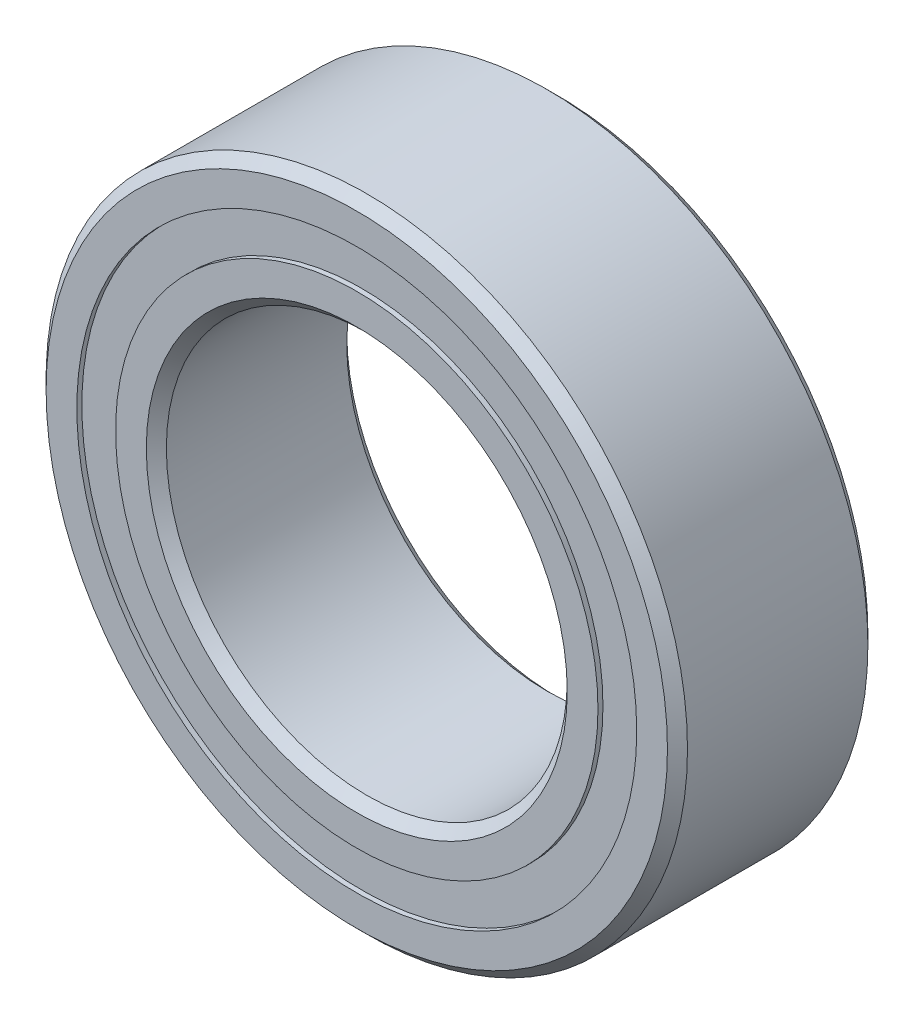
ISO-10303-21;
HEADER;
FILE_DESCRIPTION(('STEP AP214'),'2;1');
FILE_NAME('part.step','',(''),(''),'','','');
FILE_SCHEMA(('AUTOMOTIVE_DESIGN { 1 0 10303 214 1 1 1 1 }'));
ENDSEC;
DATA;
#1=APPLICATION_CONTEXT('core data for automotive mechanical design processes');
#2=APPLICATION_PROTOCOL_DEFINITION('international standard','automotive_design',2000,#1);
#3=PRODUCT_CONTEXT('',#1,'mechanical');
#4=PRODUCT('Part','Part','',(#3));
#5=PRODUCT_RELATED_PRODUCT_CATEGORY('part','',(#4));
#6=PRODUCT_DEFINITION_FORMATION('','',#4);
#7=PRODUCT_DEFINITION_CONTEXT('part definition',#1,'design');
#8=PRODUCT_DEFINITION('design','',#6,#7);
#9=PRODUCT_DEFINITION_SHAPE('','',#8);
#10=(LENGTH_UNIT() NAMED_UNIT(*) SI_UNIT(.MILLI.,.METRE.));
#11=(NAMED_UNIT(*) PLANE_ANGLE_UNIT() SI_UNIT($,.RADIAN.));
#12=(NAMED_UNIT(*) SI_UNIT($,.STERADIAN.) SOLID_ANGLE_UNIT());
#13=UNCERTAINTY_MEASURE_WITH_UNIT(LENGTH_MEASURE(1.E-05),#10,'distance_accuracy_value','');
#14=(GEOMETRIC_REPRESENTATION_CONTEXT(3) GLOBAL_UNCERTAINTY_ASSIGNED_CONTEXT((#13)) GLOBAL_UNIT_ASSIGNED_CONTEXT((#10,
#11,#12)) REPRESENTATION_CONTEXT('',''));
#15=CARTESIAN_POINT('',(0.,0.,0.));
#16=DIRECTION('',(0.,0.,1.));
#17=DIRECTION('',(1.,0.,0.));
#18=AXIS2_PLACEMENT_3D('',#15,#16,#17);
#19=CARTESIAN_POINT('',(0.,3.49175824175824,-1.1875));
#20=DIRECTION('',(0.,0.,1.));
#21=DIRECTION('',(1.,0.,0.));
#22=AXIS2_PLACEMENT_3D('',#19,#20,#21);
#23=PLANE('',#22);
#24=CARTESIAN_POINT('',(0.,0.,-1.1875));
#25=DIRECTION('',(0.,0.,1.));
#26=DIRECTION('',(1.,0.,0.));
#27=AXIS2_PLACEMENT_3D('',#24,#25,#26);
#28=CIRCLE('',#27,3.49175824175824);
#29=CARTESIAN_POINT('',(3.49175824175824,0.,-1.1875));
#30=VERTEX_POINT('',#29);
#31=EDGE_CURVE('E72',#30,#30,#28,.T.);
#32=ORIENTED_EDGE('',*,*,#31,.F.);
#33=EDGE_LOOP('',(#32));
#34=FACE_BOUND('',#33,.T.);
#35=CARTESIAN_POINT('',(0.,0.,-1.1875));
#36=DIRECTION('',(0.,0.,1.));
#37=DIRECTION('',(1.,0.,0.));
#38=AXIS2_PLACEMENT_3D('',#35,#36,#37);
#39=CIRCLE('',#38,3.00824175824176);
#40=CARTESIAN_POINT('',(3.00824175824176,0.,-1.1875));
#41=VERTEX_POINT('',#40);
#42=EDGE_CURVE('E11',#41,#41,#39,.T.);
#43=ORIENTED_EDGE('',*,*,#42,.T.);
#44=EDGE_LOOP('',(#43));
#45=FACE_BOUND('',#44,.T.);
#46=ADVANCED_FACE('F58',(#34,#45),#23,.F.);
#47=CARTESIAN_POINT('',(0.,0.,1.25));
#48=DIRECTION('',(0.,0.,1.));
#49=DIRECTION('',(1.,0.,0.));
#50=AXIS2_PLACEMENT_3D('',#47,#48,#49);
#51=CYLINDRICAL_SURFACE('',#50,3.00824175824176);
#52=ORIENTED_EDGE('',*,*,#42,.F.);
#53=EDGE_LOOP('',(#52));
#54=FACE_BOUND('',#53,.T.);
#55=CARTESIAN_POINT('',(0.,0.,-0.605878719519575));
#56=DIRECTION('',(0.,0.,1.));
#57=DIRECTION('',(1.,0.,0.));
#58=AXIS2_PLACEMENT_3D('',#55,#56,#57);
#59=CIRCLE('',#58,3.00824175824176);
#60=CARTESIAN_POINT('',(3.00824175824176,0.,-0.605878719519575));
#61=VERTEX_POINT('',#60);
#62=EDGE_CURVE('E64',#61,#61,#59,.T.);
#63=ORIENTED_EDGE('',*,*,#62,.T.);
#64=EDGE_LOOP('',(#63));
#65=FACE_BOUND('',#64,.T.);
#66=ADVANCED_FACE('F81',(#54,#65),#51,.F.);
#67=CARTESIAN_POINT('',(0.,3.49175824175824,-0.605878719519575));
#68=DIRECTION('',(0.,0.,-1.));
#69=DIRECTION('',(-1.,0.,0.));
#70=AXIS2_PLACEMENT_3D('',#67,#68,#69);
#71=PLANE('',#70);
#72=ORIENTED_EDGE('',*,*,#62,.F.);
#73=EDGE_LOOP('',(#72));
#74=FACE_BOUND('',#73,.T.);
#75=CARTESIAN_POINT('',(0.,0.,-0.605878719519575));
#76=DIRECTION('',(0.,0.,1.));
#77=DIRECTION('',(1.,0.,0.));
#78=AXIS2_PLACEMENT_3D('',#75,#76,#77);
#79=CIRCLE('',#78,3.49175824175824);
#80=CARTESIAN_POINT('',(3.49175824175824,0.,-0.605878719519575));
#81=VERTEX_POINT('',#80);
#82=EDGE_CURVE('E68',#81,#81,#79,.T.);
#83=ORIENTED_EDGE('',*,*,#82,.T.);
#84=EDGE_LOOP('',(#83));
#85=FACE_BOUND('',#84,.T.);
#86=ADVANCED_FACE('F85',(#74,#85),#71,.F.);
#87=CARTESIAN_POINT('',(0.,0.,1.25));
#88=DIRECTION('',(0.,0.,1.));
#89=DIRECTION('',(1.,0.,0.));
#90=AXIS2_PLACEMENT_3D('',#87,#88,#89);
#91=CYLINDRICAL_SURFACE('',#90,3.49175824175824);
#92=ORIENTED_EDGE('',*,*,#82,.F.);
#93=EDGE_LOOP('',(#92));
#94=FACE_BOUND('',#93,.T.);
#95=ORIENTED_EDGE('',*,*,#31,.T.);
#96=EDGE_LOOP('',(#95));
#97=FACE_BOUND('',#96,.T.);
#98=ADVANCED_FACE('F78',(#94,#97),#91,.T.);
#99=CLOSED_SHELL('',(#46,#66,#86,#98));
#100=MANIFOLD_SOLID_BREP('B2',#99);
#101=CARTESIAN_POINT('',(0.,3.49175824175824,1.1875));
#102=DIRECTION('',(0.,0.,-1.));
#103=DIRECTION('',(-1.,0.,0.));
#104=AXIS2_PLACEMENT_3D('',#101,#102,#103);
#105=PLANE('',#104);
#106=CARTESIAN_POINT('',(0.,0.,1.1875));
#107=DIRECTION('',(0.,0.,1.));
#108=DIRECTION('',(1.,0.,0.));
#109=AXIS2_PLACEMENT_3D('',#106,#107,#108);
#110=CIRCLE('',#109,3.00824175824176);
#111=CARTESIAN_POINT('',(3.00824175824176,0.,1.1875));
#112=VERTEX_POINT('',#111);
#113=EDGE_CURVE('E57',#112,#112,#110,.T.);
#114=ORIENTED_EDGE('',*,*,#113,.F.);
#115=EDGE_LOOP('',(#114));
#116=FACE_BOUND('',#115,.T.);
#117=CARTESIAN_POINT('',(0.,0.,1.1875));
#118=DIRECTION('',(0.,0.,1.));
#119=DIRECTION('',(1.,0.,0.));
#120=AXIS2_PLACEMENT_3D('',#117,#118,#119);
#121=CIRCLE('',#120,3.49175824175824);
#122=CARTESIAN_POINT('',(3.49175824175824,0.,1.1875));
#123=VERTEX_POINT('',#122);
#124=EDGE_CURVE('E140',#123,#123,#121,.T.);
#125=ORIENTED_EDGE('',*,*,#124,.T.);
#126=EDGE_LOOP('',(#125));
#127=FACE_BOUND('',#126,.T.);
#128=ADVANCED_FACE('F126',(#116,#127),#105,.F.);
#129=CARTESIAN_POINT('',(0.,0.,1.25));
#130=DIRECTION('',(0.,0.,1.));
#131=DIRECTION('',(1.,0.,0.));
#132=AXIS2_PLACEMENT_3D('',#129,#130,#131);
#133=CYLINDRICAL_SURFACE('',#132,3.00824175824176);
#134=CARTESIAN_POINT('',(0.,0.,0.605878719519573));
#135=DIRECTION('',(0.,0.,1.));
#136=DIRECTION('',(1.,0.,0.));
#137=AXIS2_PLACEMENT_3D('',#134,#135,#136);
#138=CIRCLE('',#137,3.00824175824176);
#139=CARTESIAN_POINT('',(3.00824175824176,0.,0.605878719519573));
#140=VERTEX_POINT('',#139);
#141=EDGE_CURVE('E132',#140,#140,#138,.T.);
#142=ORIENTED_EDGE('',*,*,#141,.F.);
#143=EDGE_LOOP('',(#142));
#144=FACE_BOUND('',#143,.T.);
#145=ORIENTED_EDGE('',*,*,#113,.T.);
#146=EDGE_LOOP('',(#145));
#147=FACE_BOUND('',#146,.T.);
#148=ADVANCED_FACE('F155',(#144,#147),#133,.F.);
#149=CARTESIAN_POINT('',(0.,3.49175824175824,0.605878719519573));
#150=DIRECTION('',(0.,0.,1.));
#151=DIRECTION('',(1.,0.,0.));
#152=AXIS2_PLACEMENT_3D('',#149,#150,#151);
#153=PLANE('',#152);
#154=CARTESIAN_POINT('',(0.,0.,0.605878719519573));
#155=DIRECTION('',(0.,0.,1.));
#156=DIRECTION('',(1.,0.,0.));
#157=AXIS2_PLACEMENT_3D('',#154,#155,#156);
#158=CIRCLE('',#157,3.49175824175824);
#159=CARTESIAN_POINT('',(3.49175824175824,0.,0.605878719519573));
#160=VERTEX_POINT('',#159);
#161=EDGE_CURVE('E136',#160,#160,#158,.T.);
#162=ORIENTED_EDGE('',*,*,#161,.F.);
#163=EDGE_LOOP('',(#162));
#164=FACE_BOUND('',#163,.T.);
#165=ORIENTED_EDGE('',*,*,#141,.T.);
#166=EDGE_LOOP('',(#165));
#167=FACE_BOUND('',#166,.T.);
#168=ADVANCED_FACE('F150',(#164,#167),#153,.F.);
#169=CARTESIAN_POINT('',(0.,0.,1.25));
#170=DIRECTION('',(0.,0.,1.));
#171=DIRECTION('',(1.,0.,0.));
#172=AXIS2_PLACEMENT_3D('',#169,#170,#171);
#173=CYLINDRICAL_SURFACE('',#172,3.49175824175824);
#174=ORIENTED_EDGE('',*,*,#124,.F.);
#175=EDGE_LOOP('',(#174));
#176=FACE_BOUND('',#175,.T.);
#177=ORIENTED_EDGE('',*,*,#161,.T.);
#178=EDGE_LOOP('',(#177));
#179=FACE_BOUND('',#178,.T.);
#180=ADVANCED_FACE('F147',(#176,#179),#173,.T.);
#181=CLOSED_SHELL('',(#128,#148,#168,#180));
#182=MANIFOLD_SOLID_BREP('B6',#181);
#183=CARTESIAN_POINT('',(-1.62499999999996,2.81458256229945,0.));
#184=DIRECTION('',(0.,0.,1.));
#185=DIRECTION('',(-0.499999999999989,0.866025403784445,0.));
#186=AXIS2_PLACEMENT_3D('',#183,#184,#185);
#187=SPHERICAL_SURFACE('',#186,0.605878719519574);
#188=CARTESIAN_POINT('',(-1.62499999999996,2.81458256229945,0.605878719519573));
#189=VERTEX_POINT('',#188);
#190=VERTEX_LOOP('',#189);
#191=FACE_BOUND('',#190,.T.);
#192=ADVANCED_FACE('F194',(#191),#187,.T.);
#193=CLOSED_SHELL('',(#192));
#194=MANIFOLD_SOLID_BREP('B52',#193);
#195=CARTESIAN_POINT('',(-2.81458256229941,1.62500000000003,0.));
#196=DIRECTION('',(0.,0.,1.));
#197=DIRECTION('',(-0.866025403784433,0.50000000000001,0.));
#198=AXIS2_PLACEMENT_3D('',#195,#196,#197);
#199=SPHERICAL_SURFACE('',#198,0.605878719519574);
#200=CARTESIAN_POINT('',(-2.81458256229941,1.62500000000003,0.605878719519573));
#201=VERTEX_POINT('',#200);
#202=VERTEX_LOOP('',#201);
#203=FACE_BOUND('',#202,.T.);
#204=ADVANCED_FACE('F219',(#203),#199,.T.);
#205=CLOSED_SHELL('',(#204));
#206=MANIFOLD_SOLID_BREP('B122',#205);
#207=CARTESIAN_POINT('',(-3.25,0.,0.));
#208=DIRECTION('',(0.,0.,1.));
#209=DIRECTION('',(-1.,0.,0.));
#210=AXIS2_PLACEMENT_3D('',#207,#208,#209);
#211=SPHERICAL_SURFACE('',#210,0.605878719519574);
#212=CARTESIAN_POINT('',(-3.25,0.,0.605878719519573));
#213=VERTEX_POINT('',#212);
#214=VERTEX_LOOP('',#213);
#215=FACE_BOUND('',#214,.T.);
#216=ADVANCED_FACE('F244',(#215),#211,.T.);
#217=CLOSED_SHELL('',(#216));
#218=MANIFOLD_SOLID_BREP('B190',#217);
#219=CARTESIAN_POINT('',(-2.81458256229944,-1.62499999999997,0.));
#220=DIRECTION('',(0.,0.,1.));
#221=DIRECTION('',(-0.866025403784443,-0.499999999999992,0.));
#222=AXIS2_PLACEMENT_3D('',#219,#220,#221);
#223=SPHERICAL_SURFACE('',#222,0.605878719519574);
#224=CARTESIAN_POINT('',(-2.81458256229944,-1.62499999999997,0.605878719519573));
#225=VERTEX_POINT('',#224);
#226=VERTEX_LOOP('',#225);
#227=FACE_BOUND('',#226,.T.);
#228=ADVANCED_FACE('F269',(#227),#223,.T.);
#229=CLOSED_SHELL('',(#228));
#230=MANIFOLD_SOLID_BREP('B215',#229);
#231=CARTESIAN_POINT('',(-1.62500000000002,-2.81458256229941,0.));
#232=DIRECTION('',(0.,0.,1.));
#233=DIRECTION('',(-0.500000000000007,-0.866025403784435,0.));
#234=AXIS2_PLACEMENT_3D('',#231,#232,#233);
#235=SPHERICAL_SURFACE('',#234,0.605878719519574);
#236=CARTESIAN_POINT('',(-1.62500000000002,-2.81458256229941,0.605878719519573));
#237=VERTEX_POINT('',#236);
#238=VERTEX_LOOP('',#237);
#239=FACE_BOUND('',#238,.T.);
#240=ADVANCED_FACE('F294',(#239),#235,.T.);
#241=CLOSED_SHELL('',(#240));
#242=MANIFOLD_SOLID_BREP('B240',#241);
#243=CARTESIAN_POINT('',(0.,-3.25,0.));
#244=DIRECTION('',(0.,0.,1.));
#245=DIRECTION('',(0.,-1.,0.));
#246=AXIS2_PLACEMENT_3D('',#243,#244,#245);
#247=SPHERICAL_SURFACE('',#246,0.605878719519574);
#248=CARTESIAN_POINT('',(0.,-3.25,0.605878719519573));
#249=VERTEX_POINT('',#248);
#250=VERTEX_LOOP('',#249);
#251=FACE_BOUND('',#250,.T.);
#252=ADVANCED_FACE('F319',(#251),#247,.T.);
#253=CLOSED_SHELL('',(#252));
#254=MANIFOLD_SOLID_BREP('B265',#253);
#255=CARTESIAN_POINT('',(1.62499999999998,-2.81458256229944,0.));
#256=DIRECTION('',(0.,0.,1.));
#257=DIRECTION('',(0.499999999999995,-0.866025403784442,0.));
#258=AXIS2_PLACEMENT_3D('',#255,#256,#257);
#259=SPHERICAL_SURFACE('',#258,0.605878719519574);
#260=CARTESIAN_POINT('',(1.62499999999998,-2.81458256229944,0.605878719519573));
#261=VERTEX_POINT('',#260);
#262=VERTEX_LOOP('',#261);
#263=FACE_BOUND('',#262,.T.);
#264=ADVANCED_FACE('F344',(#263),#259,.T.);
#265=CLOSED_SHELL('',(#264));
#266=MANIFOLD_SOLID_BREP('B290',#265);
#267=CARTESIAN_POINT('',(2.81458256229942,-1.62500000000001,0.));
#268=DIRECTION('',(0.,0.,1.));
#269=DIRECTION('',(0.866025403784436,-0.500000000000004,0.));
#270=AXIS2_PLACEMENT_3D('',#267,#268,#269);
#271=SPHERICAL_SURFACE('',#270,0.605878719519574);
#272=CARTESIAN_POINT('',(2.81458256229942,-1.62500000000001,0.605878719519573));
#273=VERTEX_POINT('',#272);
#274=VERTEX_LOOP('',#273);
#275=FACE_BOUND('',#274,.T.);
#276=ADVANCED_FACE('F369',(#275),#271,.T.);
#277=CLOSED_SHELL('',(#276));
#278=MANIFOLD_SOLID_BREP('B315',#277);
#279=CARTESIAN_POINT('',(3.25,0.,0.));
#280=DIRECTION('',(0.,0.,1.));
#281=DIRECTION('',(1.,0.,0.));
#282=AXIS2_PLACEMENT_3D('',#279,#280,#281);
#283=SPHERICAL_SURFACE('',#282,0.605878719519574);
#284=CARTESIAN_POINT('',(3.25,0.,0.605878719519573));
#285=VERTEX_POINT('',#284);
#286=VERTEX_LOOP('',#285);
#287=FACE_BOUND('',#286,.T.);
#288=ADVANCED_FACE('F394',(#287),#283,.T.);
#289=CLOSED_SHELL('',(#288));
#290=MANIFOLD_SOLID_BREP('B340',#289);
#291=CARTESIAN_POINT('',(2.81458256229943,1.62499999999999,0.));
#292=DIRECTION('',(0.,0.,1.));
#293=DIRECTION('',(0.86602540378444,0.499999999999998,0.));
#294=AXIS2_PLACEMENT_3D('',#291,#292,#293);
#295=SPHERICAL_SURFACE('',#294,0.605878719519574);
#296=CARTESIAN_POINT('',(2.81458256229943,1.62499999999999,0.605878719519573));
#297=VERTEX_POINT('',#296);
#298=VERTEX_LOOP('',#297);
#299=FACE_BOUND('',#298,.T.);
#300=ADVANCED_FACE('F419',(#299),#295,.T.);
#301=CLOSED_SHELL('',(#300));
#302=MANIFOLD_SOLID_BREP('B365',#301);
#303=CARTESIAN_POINT('',(1.625,2.81458256229942,0.));
#304=DIRECTION('',(0.,0.,1.));
#305=DIRECTION('',(0.500000000000001,0.866025403784438,0.));
#306=AXIS2_PLACEMENT_3D('',#303,#304,#305);
#307=SPHERICAL_SURFACE('',#306,0.605878719519574);
#308=CARTESIAN_POINT('',(1.625,2.81458256229942,0.605878719519573));
#309=VERTEX_POINT('',#308);
#310=VERTEX_LOOP('',#309);
#311=FACE_BOUND('',#310,.T.);
#312=ADVANCED_FACE('F444',(#311),#307,.T.);
#313=CLOSED_SHELL('',(#312));
#314=MANIFOLD_SOLID_BREP('B390',#313);
#315=CARTESIAN_POINT('',(0.,3.25,0.));
#316=DIRECTION('',(0.,0.,1.));
#317=DIRECTION('',(0.,1.,0.));
#318=AXIS2_PLACEMENT_3D('',#315,#316,#317);
#319=SPHERICAL_SURFACE('',#318,0.605878719519574);
#320=CARTESIAN_POINT('',(0.,3.25,0.605878719519573));
#321=VERTEX_POINT('',#320);
#322=VERTEX_LOOP('',#321);
#323=FACE_BOUND('',#322,.T.);
#324=ADVANCED_FACE('F471',(#323),#319,.T.);
#325=CLOSED_SHELL('',(#324));
#326=MANIFOLD_SOLID_BREP('B415',#325);
#327=CARTESIAN_POINT('',(0.,3.00824175824176,1.25));
#328=DIRECTION('',(0.,0.,-1.));
#329=DIRECTION('',(-1.,0.,0.));
#330=AXIS2_PLACEMENT_3D('',#327,#328,#329);
#331=PLANE('',#330);
#332=CARTESIAN_POINT('',(0.,0.,1.25));
#333=DIRECTION('',(0.,0.,1.));
#334=DIRECTION('',(1.,0.,0.));
#335=AXIS2_PLACEMENT_3D('',#332,#333,#334);
#336=CIRCLE('',#335,2.625);
#337=CARTESIAN_POINT('',(2.625,0.,1.25));
#338=VERTEX_POINT('',#337);
#339=EDGE_CURVE('E519',#338,#338,#336,.T.);
#340=ORIENTED_EDGE('',*,*,#339,.F.);
#341=EDGE_LOOP('',(#340));
#342=FACE_BOUND('',#341,.T.);
#343=CARTESIAN_POINT('',(0.,0.,1.25));
#344=DIRECTION('',(0.,0.,1.));
#345=DIRECTION('',(1.,0.,0.));
#346=AXIS2_PLACEMENT_3D('',#343,#344,#345);
#347=CIRCLE('',#346,3.00824175824176);
#348=CARTESIAN_POINT('',(3.00824175824176,0.,1.25));
#349=VERTEX_POINT('',#348);
#350=EDGE_CURVE('E470',#349,#349,#347,.T.);
#351=ORIENTED_EDGE('',*,*,#350,.T.);
#352=EDGE_LOOP('',(#351));
#353=FACE_BOUND('',#352,.T.);
#354=ADVANCED_FACE('F491',(#342,#353),#331,.F.);
#355=CARTESIAN_POINT('',(0.,0.,1.25));
#356=DIRECTION('',(0.,0.,1.));
#357=DIRECTION('',(1.,0.,0.));
#358=AXIS2_PLACEMENT_3D('',#355,#356,#357);
#359=CYLINDRICAL_SURFACE('',#358,3.00824175824176);
#360=ORIENTED_EDGE('',*,*,#350,.F.);
#361=EDGE_LOOP('',(#360));
#362=FACE_BOUND('',#361,.T.);
#363=CARTESIAN_POINT('',(0.,0.,0.555555555555555));
#364=DIRECTION('',(0.,0.,1.));
#365=DIRECTION('',(1.,0.,0.));
#366=AXIS2_PLACEMENT_3D('',#363,#364,#365);
#367=CIRCLE('',#366,3.00824175824176);
#368=CARTESIAN_POINT('',(3.00824175824176,0.,0.555555555555555));
#369=VERTEX_POINT('',#368);
#370=EDGE_CURVE('E497',#369,#369,#367,.T.);
#371=ORIENTED_EDGE('',*,*,#370,.T.);
#372=EDGE_LOOP('',(#371));
#373=FACE_BOUND('',#372,.T.);
#374=ADVANCED_FACE('F526',(#362,#373),#359,.T.);
#375=CARTESIAN_POINT('',(0.,0.,0.));
#376=DIRECTION('',(0.,0.,1.));
#377=DIRECTION('',(1.,0.,0.));
#378=AXIS2_PLACEMENT_3D('',#375,#376,#377);
#379=TOROIDAL_SURFACE('',#378,3.25,0.605878719519573);
#380=ORIENTED_EDGE('',*,*,#370,.F.);
#381=EDGE_LOOP('',(#380));
#382=FACE_BOUND('',#381,.T.);
#383=CARTESIAN_POINT('',(0.,0.,-0.555555555555557));
#384=DIRECTION('',(0.,0.,1.));
#385=DIRECTION('',(1.,0.,0.));
#386=AXIS2_PLACEMENT_3D('',#383,#384,#385);
#387=CIRCLE('',#386,3.00824175824176);
#388=CARTESIAN_POINT('',(3.00824175824176,0.,-0.555555555555557));
#389=VERTEX_POINT('',#388);
#390=EDGE_CURVE('E501',#389,#389,#387,.T.);
#391=ORIENTED_EDGE('',*,*,#390,.T.);
#392=EDGE_LOOP('',(#391));
#393=FACE_BOUND('',#392,.T.);
#394=ADVANCED_FACE('F530',(#382,#393),#379,.F.);
#395=CARTESIAN_POINT('',(0.,0.,1.25));
#396=DIRECTION('',(0.,0.,1.));
#397=DIRECTION('',(1.,0.,0.));
#398=AXIS2_PLACEMENT_3D('',#395,#396,#397);
#399=CYLINDRICAL_SURFACE('',#398,3.00824175824176);
#400=ORIENTED_EDGE('',*,*,#390,.F.);
#401=EDGE_LOOP('',(#400));
#402=FACE_BOUND('',#401,.T.);
#403=CARTESIAN_POINT('',(0.,0.,-1.25));
#404=DIRECTION('',(0.,0.,1.));
#405=DIRECTION('',(1.,0.,0.));
#406=AXIS2_PLACEMENT_3D('',#403,#404,#405);
#407=CIRCLE('',#406,3.00824175824176);
#408=CARTESIAN_POINT('',(3.00824175824176,0.,-1.25));
#409=VERTEX_POINT('',#408);
#410=EDGE_CURVE('E505',#409,#409,#407,.T.);
#411=ORIENTED_EDGE('',*,*,#410,.T.);
#412=EDGE_LOOP('',(#411));
#413=FACE_BOUND('',#412,.T.);
#414=ADVANCED_FACE('F535',(#402,#413),#399,.T.);
#415=CARTESIAN_POINT('',(0.,2.625,-1.25));
#416=DIRECTION('',(0.,0.,1.));
#417=DIRECTION('',(1.,0.,0.));
#418=AXIS2_PLACEMENT_3D('',#415,#416,#417);
#419=PLANE('',#418);
#420=ORIENTED_EDGE('',*,*,#410,.F.);
#421=EDGE_LOOP('',(#420));
#422=FACE_BOUND('',#421,.T.);
#423=CARTESIAN_POINT('',(0.,0.,-1.25));
#424=DIRECTION('',(0.,0.,1.));
#425=DIRECTION('',(1.,0.,0.));
#426=AXIS2_PLACEMENT_3D('',#423,#424,#425);
#427=CIRCLE('',#426,2.625);
#428=CARTESIAN_POINT('',(2.625,0.,-1.25));
#429=VERTEX_POINT('',#428);
#430=EDGE_CURVE('E510',#429,#429,#427,.T.);
#431=ORIENTED_EDGE('',*,*,#430,.T.);
#432=EDGE_LOOP('',(#431));
#433=FACE_BOUND('',#432,.T.);
#434=ADVANCED_FACE('F541',(#422,#433),#419,.F.);
#435=CARTESIAN_POINT('',(0.,0.,-1.125));
#436=DIRECTION('',(0.,0.,-1.));
#437=DIRECTION('',(-1.,0.,0.));
#438=AXIS2_PLACEMENT_3D('',#435,#436,#437);
#439=CONICAL_SURFACE('',#438,2.5,0.78539816339745);
#440=ORIENTED_EDGE('',*,*,#430,.F.);
#441=EDGE_LOOP('',(#440));
#442=FACE_BOUND('',#441,.T.);
#443=CARTESIAN_POINT('',(0.,0.,-1.125));
#444=DIRECTION('',(0.,0.,1.));
#445=DIRECTION('',(1.,0.,0.));
#446=AXIS2_PLACEMENT_3D('',#443,#444,#445);
#447=CIRCLE('',#446,2.5);
#448=CARTESIAN_POINT('',(2.5,0.,-1.125));
#449=VERTEX_POINT('',#448);
#450=EDGE_CURVE('E513',#449,#449,#447,.T.);
#451=ORIENTED_EDGE('',*,*,#450,.T.);
#452=EDGE_LOOP('',(#451));
#453=FACE_BOUND('',#452,.T.);
#454=ADVANCED_FACE('F545',(#442,#453),#439,.F.);
#455=CARTESIAN_POINT('',(0.,0.,1.25));
#456=DIRECTION('',(0.,0.,1.));
#457=DIRECTION('',(1.,0.,0.));
#458=AXIS2_PLACEMENT_3D('',#455,#456,#457);
#459=CYLINDRICAL_SURFACE('',#458,2.5);
#460=ORIENTED_EDGE('',*,*,#450,.F.);
#461=EDGE_LOOP('',(#460));
#462=FACE_BOUND('',#461,.T.);
#463=CARTESIAN_POINT('',(0.,0.,1.125));
#464=DIRECTION('',(0.,0.,1.));
#465=DIRECTION('',(1.,0.,0.));
#466=AXIS2_PLACEMENT_3D('',#463,#464,#465);
#467=CIRCLE('',#466,2.5);
#468=CARTESIAN_POINT('',(2.5,0.,1.125));
#469=VERTEX_POINT('',#468);
#470=EDGE_CURVE('E516',#469,#469,#467,.T.);
#471=ORIENTED_EDGE('',*,*,#470,.T.);
#472=EDGE_LOOP('',(#471));
#473=FACE_BOUND('',#472,.T.);
#474=ADVANCED_FACE('F549',(#462,#473),#459,.F.);
#475=CARTESIAN_POINT('',(0.,0.,1.25));
#476=DIRECTION('',(0.,0.,1.));
#477=DIRECTION('',(1.,0.,0.));
#478=AXIS2_PLACEMENT_3D('',#475,#476,#477);
#479=CONICAL_SURFACE('',#478,2.625,0.785398163397447);
#480=ORIENTED_EDGE('',*,*,#470,.F.);
#481=EDGE_LOOP('',(#480));
#482=FACE_BOUND('',#481,.T.);
#483=ORIENTED_EDGE('',*,*,#339,.T.);
#484=EDGE_LOOP('',(#483));
#485=FACE_BOUND('',#484,.T.);
#486=ADVANCED_FACE('F523',(#482,#485),#479,.F.);
#487=CLOSED_SHELL('',(#354,#374,#394,#414,#434,#454,#474,#486));
#488=MANIFOLD_SOLID_BREP('B440',#487);
#489=CARTESIAN_POINT('',(0.,0.,1.125));
#490=DIRECTION('',(0.,0.,-1.));
#491=DIRECTION('',(-1.,0.,0.));
#492=AXIS2_PLACEMENT_3D('',#489,#490,#491);
#493=CONICAL_SURFACE('',#492,4.,0.785398163397451);
#494=CARTESIAN_POINT('',(0.,0.,1.25));
#495=DIRECTION('',(0.,0.,1.));
#496=DIRECTION('',(1.,0.,0.));
#497=AXIS2_PLACEMENT_3D('',#494,#495,#496);
#498=CIRCLE('',#497,3.875);
#499=CARTESIAN_POINT('',(3.875,0.,1.25));
#500=VERTEX_POINT('',#499);
#501=EDGE_CURVE('E648',#500,#500,#498,.T.);
#502=ORIENTED_EDGE('',*,*,#501,.F.);
#503=EDGE_LOOP('',(#502));
#504=FACE_BOUND('',#503,.T.);
#505=CARTESIAN_POINT('',(0.,0.,1.125));
#506=DIRECTION('',(0.,0.,1.));
#507=DIRECTION('',(1.,0.,0.));
#508=AXIS2_PLACEMENT_3D('',#505,#506,#507);
#509=CIRCLE('',#508,4.);
#510=CARTESIAN_POINT('',(4.,0.,1.125));
#511=VERTEX_POINT('',#510);
#512=EDGE_CURVE('E490',#511,#511,#509,.T.);
#513=ORIENTED_EDGE('',*,*,#512,.T.);
#514=EDGE_LOOP('',(#513));
#515=FACE_BOUND('',#514,.T.);
#516=ADVANCED_FACE('F613',(#504,#515),#493,.T.);
#517=CARTESIAN_POINT('',(0.,0.,1.25));
#518=DIRECTION('',(0.,0.,1.));
#519=DIRECTION('',(1.,0.,0.));
#520=AXIS2_PLACEMENT_3D('',#517,#518,#519);
#521=CYLINDRICAL_SURFACE('',#520,4.);
#522=ORIENTED_EDGE('',*,*,#512,.F.);
#523=EDGE_LOOP('',(#522));
#524=FACE_BOUND('',#523,.T.);
#525=CARTESIAN_POINT('',(0.,0.,-1.125));
#526=DIRECTION('',(0.,0.,1.));
#527=DIRECTION('',(1.,0.,0.));
#528=AXIS2_PLACEMENT_3D('',#525,#526,#527);
#529=CIRCLE('',#528,4.);
#530=CARTESIAN_POINT('',(4.,0.,-1.125));
#531=VERTEX_POINT('',#530);
#532=EDGE_CURVE('E620',#531,#531,#529,.T.);
#533=ORIENTED_EDGE('',*,*,#532,.T.);
#534=EDGE_LOOP('',(#533));
#535=FACE_BOUND('',#534,.T.);
#536=ADVANCED_FACE('F656',(#524,#535),#521,.T.);
#537=CARTESIAN_POINT('',(0.,0.,-1.25));
#538=DIRECTION('',(0.,0.,1.));
#539=DIRECTION('',(1.,0.,0.));
#540=AXIS2_PLACEMENT_3D('',#537,#538,#539);
#541=CONICAL_SURFACE('',#540,3.875,0.78539816339745);
#542=ORIENTED_EDGE('',*,*,#532,.F.);
#543=EDGE_LOOP('',(#542));
#544=FACE_BOUND('',#543,.T.);
#545=CARTESIAN_POINT('',(0.,0.,-1.25));
#546=DIRECTION('',(0.,0.,1.));
#547=DIRECTION('',(1.,0.,0.));
#548=AXIS2_PLACEMENT_3D('',#545,#546,#547);
#549=CIRCLE('',#548,3.875);
#550=CARTESIAN_POINT('',(3.875,0.,-1.25));
#551=VERTEX_POINT('',#550);
#552=EDGE_CURVE('E625',#551,#551,#549,.T.);
#553=ORIENTED_EDGE('',*,*,#552,.T.);
#554=EDGE_LOOP('',(#553));
#555=FACE_BOUND('',#554,.T.);
#556=ADVANCED_FACE('F660',(#544,#555),#541,.T.);
#557=CARTESIAN_POINT('',(0.,3.875,-1.25));
#558=DIRECTION('',(0.,0.,1.));
#559=DIRECTION('',(1.,0.,0.));
#560=AXIS2_PLACEMENT_3D('',#557,#558,#559);
#561=PLANE('',#560);
#562=ORIENTED_EDGE('',*,*,#552,.F.);
#563=EDGE_LOOP('',(#562));
#564=FACE_BOUND('',#563,.T.);
#565=CARTESIAN_POINT('',(0.,0.,-1.25));
#566=DIRECTION('',(0.,0.,1.));
#567=DIRECTION('',(1.,0.,0.));
#568=AXIS2_PLACEMENT_3D('',#565,#566,#567);
#569=CIRCLE('',#568,3.49175824175824);
#570=CARTESIAN_POINT('',(3.49175824175824,0.,-1.25));
#571=VERTEX_POINT('',#570);
#572=EDGE_CURVE('E630',#571,#571,#569,.T.);
#573=ORIENTED_EDGE('',*,*,#572,.T.);
#574=EDGE_LOOP('',(#573));
#575=FACE_BOUND('',#574,.T.);
#576=ADVANCED_FACE('F665',(#564,#575),#561,.F.);
#577=CARTESIAN_POINT('',(0.,0.,1.25));
#578=DIRECTION('',(0.,0.,1.));
#579=DIRECTION('',(1.,0.,0.));
#580=AXIS2_PLACEMENT_3D('',#577,#578,#579);
#581=CYLINDRICAL_SURFACE('',#580,3.49175824175824);
#582=ORIENTED_EDGE('',*,*,#572,.F.);
#583=EDGE_LOOP('',(#582));
#584=FACE_BOUND('',#583,.T.);
#585=CARTESIAN_POINT('',(0.,0.,-0.555555555555556));
#586=DIRECTION('',(0.,0.,1.));
#587=DIRECTION('',(1.,0.,0.));
#588=AXIS2_PLACEMENT_3D('',#585,#586,#587);
#589=CIRCLE('',#588,3.49175824175824);
#590=CARTESIAN_POINT('',(3.49175824175824,0.,-0.555555555555556));
#591=VERTEX_POINT('',#590);
#592=EDGE_CURVE('E636',#591,#591,#589,.T.);
#593=ORIENTED_EDGE('',*,*,#592,.T.);
#594=EDGE_LOOP('',(#593));
#595=FACE_BOUND('',#594,.T.);
#596=ADVANCED_FACE('F671',(#584,#595),#581,.F.);
#597=CARTESIAN_POINT('',(0.,0.,0.));
#598=DIRECTION('',(0.,0.,1.));
#599=DIRECTION('',(1.,0.,0.));
#600=AXIS2_PLACEMENT_3D('',#597,#598,#599);
#601=TOROIDAL_SURFACE('',#600,3.25,0.605878719519574);
#602=ORIENTED_EDGE('',*,*,#592,.F.);
#603=EDGE_LOOP('',(#602));
#604=FACE_BOUND('',#603,.T.);
#605=CARTESIAN_POINT('',(0.,0.,0.555555555555555));
#606=DIRECTION('',(0.,0.,1.));
#607=DIRECTION('',(1.,0.,0.));
#608=AXIS2_PLACEMENT_3D('',#605,#606,#607);
#609=CIRCLE('',#608,3.49175824175824);
#610=CARTESIAN_POINT('',(3.49175824175824,0.,0.555555555555555));
#611=VERTEX_POINT('',#610);
#612=EDGE_CURVE('E640',#611,#611,#609,.T.);
#613=ORIENTED_EDGE('',*,*,#612,.T.);
#614=EDGE_LOOP('',(#613));
#615=FACE_BOUND('',#614,.T.);
#616=ADVANCED_FACE('F675',(#604,#615),#601,.F.);
#617=CARTESIAN_POINT('',(0.,0.,1.25));
#618=DIRECTION('',(0.,0.,1.));
#619=DIRECTION('',(1.,0.,0.));
#620=AXIS2_PLACEMENT_3D('',#617,#618,#619);
#621=CYLINDRICAL_SURFACE('',#620,3.49175824175824);
#622=ORIENTED_EDGE('',*,*,#612,.F.);
#623=EDGE_LOOP('',(#622));
#624=FACE_BOUND('',#623,.T.);
#625=CARTESIAN_POINT('',(0.,0.,1.25));
#626=DIRECTION('',(0.,0.,1.));
#627=DIRECTION('',(1.,0.,0.));
#628=AXIS2_PLACEMENT_3D('',#625,#626,#627);
#629=CIRCLE('',#628,3.49175824175824);
#630=CARTESIAN_POINT('',(3.49175824175824,0.,1.25));
#631=VERTEX_POINT('',#630);
#632=EDGE_CURVE('E644',#631,#631,#629,.T.);
#633=ORIENTED_EDGE('',*,*,#632,.T.);
#634=EDGE_LOOP('',(#633));
#635=FACE_BOUND('',#634,.T.);
#636=ADVANCED_FACE('F679',(#624,#635),#621,.F.);
#637=CARTESIAN_POINT('',(0.,3.875,1.25));
#638=DIRECTION('',(0.,0.,-1.));
#639=DIRECTION('',(-1.,0.,0.));
#640=AXIS2_PLACEMENT_3D('',#637,#638,#639);
#641=PLANE('',#640);
#642=ORIENTED_EDGE('',*,*,#632,.F.);
#643=EDGE_LOOP('',(#642));
#644=FACE_BOUND('',#643,.T.);
#645=ORIENTED_EDGE('',*,*,#501,.T.);
#646=EDGE_LOOP('',(#645));
#647=FACE_BOUND('',#646,.T.);
#648=ADVANCED_FACE('F653',(#644,#647),#641,.F.);
#649=CLOSED_SHELL('',(#516,#536,#556,#576,#596,#616,#636,#648));
#650=MANIFOLD_SOLID_BREP('B465',#649);
#651=ADVANCED_BREP_SHAPE_REPRESENTATION('',(#18,#100,#182,#194,#206,#218,#230,#242,#254,#266,
#278,#290,#302,#314,#326,#488,#650),#14);
#652=SHAPE_DEFINITION_REPRESENTATION(#9,#651);
ENDSEC;
END-ISO-10303-21;
